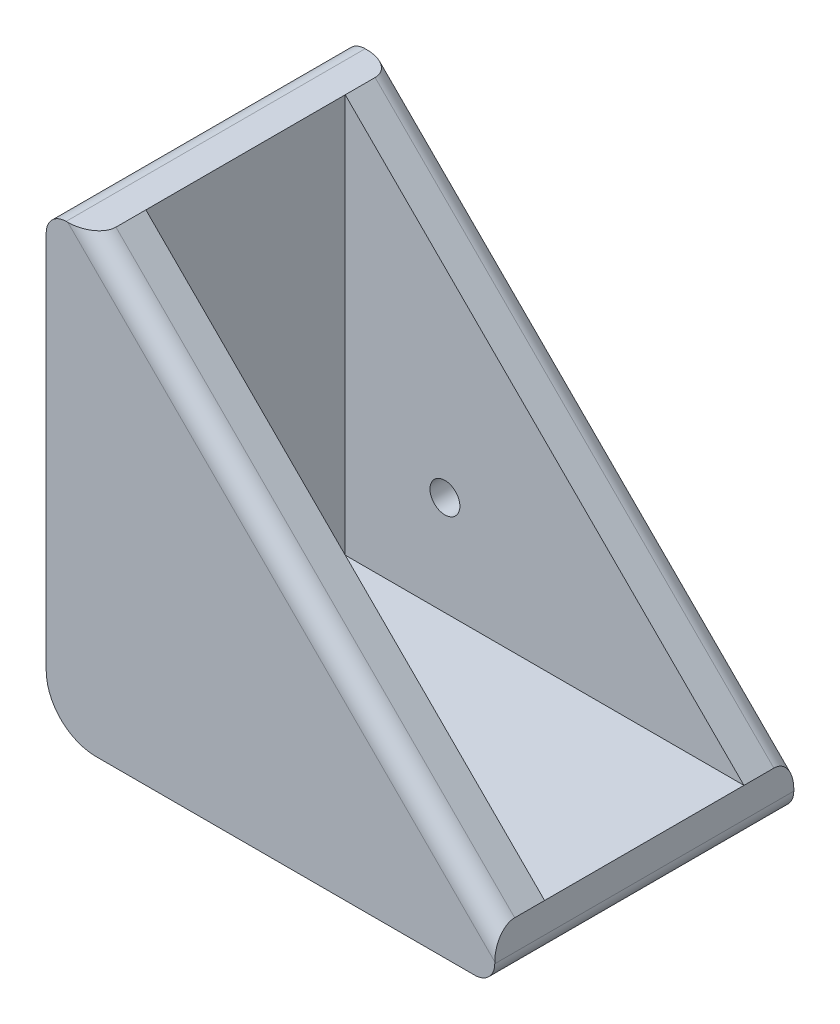
ISO-10303-21;
HEADER;
FILE_DESCRIPTION(('STEP AP214'),'2;1');
FILE_NAME('part.step','',(''),(''),'','','');
FILE_SCHEMA(('AUTOMOTIVE_DESIGN { 1 0 10303 214 1 1 1 1 }'));
ENDSEC;
DATA;
#1=APPLICATION_CONTEXT('core data for automotive mechanical design processes');
#2=APPLICATION_PROTOCOL_DEFINITION('international standard','automotive_design',2000,#1);
#3=PRODUCT_CONTEXT('',#1,'mechanical');
#4=PRODUCT('Part','Part','',(#3));
#5=PRODUCT_RELATED_PRODUCT_CATEGORY('part','',(#4));
#6=PRODUCT_DEFINITION_FORMATION('','',#4);
#7=PRODUCT_DEFINITION_CONTEXT('part definition',#1,'design');
#8=PRODUCT_DEFINITION('design','',#6,#7);
#9=PRODUCT_DEFINITION_SHAPE('','',#8);
#10=(LENGTH_UNIT() NAMED_UNIT(*) SI_UNIT(.MILLI.,.METRE.));
#11=(NAMED_UNIT(*) PLANE_ANGLE_UNIT() SI_UNIT($,.RADIAN.));
#12=(NAMED_UNIT(*) SI_UNIT($,.STERADIAN.) SOLID_ANGLE_UNIT());
#13=UNCERTAINTY_MEASURE_WITH_UNIT(LENGTH_MEASURE(1.E-05),#10,'distance_accuracy_value','');
#14=(GEOMETRIC_REPRESENTATION_CONTEXT(3) GLOBAL_UNCERTAINTY_ASSIGNED_CONTEXT((#13)) GLOBAL_UNIT_ASSIGNED_CONTEXT((#10,
#11,#12)) REPRESENTATION_CONTEXT('',''));
#15=CARTESIAN_POINT('',(0.,0.,0.));
#16=DIRECTION('',(0.,0.,1.));
#17=DIRECTION('',(1.,0.,0.));
#18=AXIS2_PLACEMENT_3D('',#15,#16,#17);
#19=CARTESIAN_POINT('',(5.,5.,30.));
#20=DIRECTION('',(0.,-1.,0.));
#21=DIRECTION('',(1.,0.,0.));
#22=AXIS2_PLACEMENT_3D('',#19,#20,#21);
#23=PLANE('',#22);
#24=CARTESIAN_POINT('',(15.,5.,15.));
#25=DIRECTION('',(0.,-1.,0.));
#26=DIRECTION('',(1.,0.,0.));
#27=AXIS2_PLACEMENT_3D('',#24,#25,#26);
#28=CIRCLE('',#27,1.5);
#29=CARTESIAN_POINT('',(16.5,5.,15.));
#30=VERTEX_POINT('',#29);
#31=EDGE_CURVE('E251',#30,#30,#28,.T.);
#32=ORIENTED_EDGE('',*,*,#31,.T.);
#33=EDGE_LOOP('',(#32));
#34=FACE_BOUND('',#33,.T.);
#35=DIRECTION('',(0.,0.,-1.));
#36=VECTOR('',#35,1.);
#37=CARTESIAN_POINT('',(45.,5.,30.));
#38=LINE('',#37,#36);
#39=CARTESIAN_POINT('',(45.,5.,25.));
#40=VERTEX_POINT('',#39);
#41=CARTESIAN_POINT('',(45.,5.,5.));
#42=VERTEX_POINT('',#41);
#43=EDGE_CURVE('E152',#40,#42,#38,.T.);
#44=ORIENTED_EDGE('',*,*,#43,.T.);
#45=DIRECTION('',(-1.,0.,0.));
#46=VECTOR('',#45,1.);
#47=CARTESIAN_POINT('',(5.,5.,5.));
#48=LINE('',#47,#46);
#49=CARTESIAN_POINT('',(5.,5.,5.));
#50=VERTEX_POINT('',#49);
#51=EDGE_CURVE('E151',#42,#50,#48,.T.);
#52=ORIENTED_EDGE('',*,*,#51,.T.);
#53=DIRECTION('',(0.,0.,-1.));
#54=VECTOR('',#53,1.);
#55=CARTESIAN_POINT('',(5.,5.,30.));
#56=LINE('',#55,#54);
#57=CARTESIAN_POINT('',(5.,5.,25.));
#58=VERTEX_POINT('',#57);
#59=EDGE_CURVE('E144',#58,#50,#56,.T.);
#60=ORIENTED_EDGE('',*,*,#59,.F.);
#61=DIRECTION('',(1.,0.,0.));
#62=VECTOR('',#61,1.);
#63=CARTESIAN_POINT('',(45.,5.,25.));
#64=LINE('',#63,#62);
#65=EDGE_CURVE('E129',#58,#40,#64,.T.);
#66=ORIENTED_EDGE('',*,*,#65,.T.);
#67=EDGE_LOOP('',(#44,#52,#60,#66));
#68=FACE_BOUND('',#67,.T.);
#69=ADVANCED_FACE('F33',(#34,#68),#23,.F.);
#70=CARTESIAN_POINT('',(5.,45.,30.));
#71=DIRECTION('',(-1.,0.,0.));
#72=DIRECTION('',(0.,-1.,0.));
#73=AXIS2_PLACEMENT_3D('',#70,#71,#72);
#74=PLANE('',#73);
#75=ORIENTED_EDGE('',*,*,#59,.T.);
#76=DIRECTION('',(0.,1.,0.));
#77=VECTOR('',#76,1.);
#78=CARTESIAN_POINT('',(5.,45.,5.));
#79=LINE('',#78,#77);
#80=CARTESIAN_POINT('',(5.,45.,5.));
#81=VERTEX_POINT('',#80);
#82=EDGE_CURVE('E250',#50,#81,#79,.T.);
#83=ORIENTED_EDGE('',*,*,#82,.T.);
#84=DIRECTION('',(0.,0.,-1.));
#85=VECTOR('',#84,1.);
#86=CARTESIAN_POINT('',(5.,45.,30.));
#87=LINE('',#86,#85);
#88=CARTESIAN_POINT('',(5.,45.,25.));
#89=VERTEX_POINT('',#88);
#90=EDGE_CURVE('E147',#89,#81,#87,.T.);
#91=ORIENTED_EDGE('',*,*,#90,.F.);
#92=DIRECTION('',(0.,-1.,0.));
#93=VECTOR('',#92,1.);
#94=CARTESIAN_POINT('',(5.,5.,25.));
#95=LINE('',#94,#93);
#96=EDGE_CURVE('E132',#89,#58,#95,.T.);
#97=ORIENTED_EDGE('',*,*,#96,.T.);
#98=EDGE_LOOP('',(#75,#83,#91,#97));
#99=FACE_BOUND('',#98,.T.);
#100=ADVANCED_FACE('F143',(#99),#74,.F.);
#101=CARTESIAN_POINT('',(45.,0.,30.));
#102=DIRECTION('',(0.,1.,0.));
#103=DIRECTION('',(-1.,0.,0.));
#104=AXIS2_PLACEMENT_3D('',#101,#102,#103);
#105=PLANE('',#104);
#106=CARTESIAN_POINT('',(15.,0.,15.));
#107=DIRECTION('',(0.,-1.,0.));
#108=DIRECTION('',(1.,0.,0.));
#109=AXIS2_PLACEMENT_3D('',#106,#107,#108);
#110=CIRCLE('',#109,1.5);
#111=CARTESIAN_POINT('',(16.5,0.,15.));
#112=VERTEX_POINT('',#111);
#113=EDGE_CURVE('E255',#112,#112,#110,.T.);
#114=ORIENTED_EDGE('',*,*,#113,.F.);
#115=EDGE_LOOP('',(#114));
#116=FACE_BOUND('',#115,.T.);
#117=DIRECTION('',(1.,0.,0.));
#118=VECTOR('',#117,1.);
#119=CARTESIAN_POINT('',(45.,0.,30.));
#120=LINE('',#119,#118);
#121=CARTESIAN_POINT('',(5.00000000000002,0.,30.));
#122=VERTEX_POINT('',#121);
#123=CARTESIAN_POINT('',(43.,0.,30.));
#124=VERTEX_POINT('',#123);
#125=EDGE_CURVE('E206',#122,#124,#120,.T.);
#126=ORIENTED_EDGE('',*,*,#125,.F.);
#127=DIRECTION('',(0.,0.,-1.));
#128=VECTOR('',#127,1.);
#129=CARTESIAN_POINT('',(5.,0.,30.));
#130=LINE('',#129,#128);
#131=CARTESIAN_POINT('',(5.00000000000002,0.,0.));
#132=VERTEX_POINT('',#131);
#133=EDGE_CURVE('E198',#122,#132,#130,.T.);
#134=ORIENTED_EDGE('',*,*,#133,.T.);
#135=DIRECTION('',(1.,0.,0.));
#136=VECTOR('',#135,1.);
#137=CARTESIAN_POINT('',(45.,0.,0.));
#138=LINE('',#137,#136);
#139=CARTESIAN_POINT('',(43.,0.,0.));
#140=VERTEX_POINT('',#139);
#141=EDGE_CURVE('E205',#132,#140,#138,.T.);
#142=ORIENTED_EDGE('',*,*,#141,.T.);
#143=DIRECTION('',(0.,0.,-1.));
#144=VECTOR('',#143,1.);
#145=CARTESIAN_POINT('',(43.,0.,30.));
#146=LINE('',#145,#144);
#147=EDGE_CURVE('E195',#140,#124,#146,.F.);
#148=ORIENTED_EDGE('',*,*,#147,.T.);
#149=EDGE_LOOP('',(#126,#134,#142,#148));
#150=FACE_BOUND('',#149,.T.);
#151=ADVANCED_FACE('F204',(#116,#150),#105,.F.);
#152=CARTESIAN_POINT('',(45.,5.,30.));
#153=DIRECTION('',(-1.,0.,0.));
#154=DIRECTION('',(0.,0.,1.));
#155=AXIS2_PLACEMENT_3D('',#152,#153,#154);
#156=PLANE('',#155);
#157=DIRECTION('',(0.,1.,0.));
#158=VECTOR('',#157,1.);
#159=CARTESIAN_POINT('',(45.,5.,0.));
#160=LINE('',#159,#158);
#161=CARTESIAN_POINT('',(45.,2.,0.));
#162=VERTEX_POINT('',#161);
#163=CARTESIAN_POINT('',(45.,2.17157287525381,0.));
#164=VERTEX_POINT('',#163);
#165=EDGE_CURVE('E212',#162,#164,#160,.T.);
#166=ORIENTED_EDGE('',*,*,#165,.T.);
#167=CARTESIAN_POINT('',(45.,2.17157287525381,2.));
#168=DIRECTION('',(-1.,0.,0.));
#169=DIRECTION('',(0.,-1.,0.));
#170=AXIS2_PLACEMENT_3D('',#167,#168,#169);
#171=ELLIPSE('',#170,2.82842712474619,2.);
#172=CARTESIAN_POINT('',(45.,5.,2.));
#173=VERTEX_POINT('',#172);
#174=EDGE_CURVE('E173',#164,#173,#171,.F.);
#175=ORIENTED_EDGE('',*,*,#174,.T.);
#176=DIRECTION('',(0.,0.,-1.));
#177=VECTOR('',#176,1.);
#178=CARTESIAN_POINT('',(45.,5.,5.));
#179=LINE('',#178,#177);
#180=EDGE_CURVE('E246',#42,#173,#179,.T.);
#181=ORIENTED_EDGE('',*,*,#180,.F.);
#182=ORIENTED_EDGE('',*,*,#43,.F.);
#183=CARTESIAN_POINT('',(45.,5.,28.));
#184=VERTEX_POINT('',#183);
#185=EDGE_CURVE('E155',#184,#40,#38,.T.);
#186=ORIENTED_EDGE('',*,*,#185,.F.);
#187=CARTESIAN_POINT('',(45.,2.17157287525381,28.));
#188=DIRECTION('',(-1.,0.,0.));
#189=DIRECTION('',(0.,-1.,0.));
#190=AXIS2_PLACEMENT_3D('',#187,#188,#189);
#191=ELLIPSE('',#190,2.82842712474619,2.);
#192=CARTESIAN_POINT('',(45.,2.17157287525381,30.));
#193=VERTEX_POINT('',#192);
#194=EDGE_CURVE('E171',#184,#193,#191,.F.);
#195=ORIENTED_EDGE('',*,*,#194,.T.);
#196=DIRECTION('',(0.,1.,0.));
#197=VECTOR('',#196,1.);
#198=CARTESIAN_POINT('',(45.,5.,30.));
#199=LINE('',#198,#197);
#200=CARTESIAN_POINT('',(45.,2.,30.));
#201=VERTEX_POINT('',#200);
#202=EDGE_CURVE('E224',#201,#193,#199,.T.);
#203=ORIENTED_EDGE('',*,*,#202,.F.);
#204=DIRECTION('',(0.,0.,-1.));
#205=VECTOR('',#204,1.);
#206=CARTESIAN_POINT('',(45.,2.,30.));
#207=LINE('',#206,#205);
#208=EDGE_CURVE('E168',#201,#162,#207,.T.);
#209=ORIENTED_EDGE('',*,*,#208,.T.);
#210=EDGE_LOOP('',(#166,#175,#181,#182,#186,#195,#203,#209));
#211=FACE_BOUND('',#210,.T.);
#212=ADVANCED_FACE('F279',(#211),#156,.F.);
#213=CARTESIAN_POINT('',(0.,45.,30.));
#214=DIRECTION('',(0.,-1.,0.));
#215=DIRECTION('',(0.,0.,-1.));
#216=AXIS2_PLACEMENT_3D('',#213,#214,#215);
#217=PLANE('',#216);
#218=DIRECTION('',(0.,0.,-1.));
#219=VECTOR('',#218,1.);
#220=CARTESIAN_POINT('',(5.,45.,5.));
#221=LINE('',#220,#219);
#222=CARTESIAN_POINT('',(5.,45.,2.));
#223=VERTEX_POINT('',#222);
#224=EDGE_CURVE('E148',#81,#223,#221,.T.);
#225=ORIENTED_EDGE('',*,*,#224,.T.);
#226=CARTESIAN_POINT('',(2.1715728752538,45.,2.));
#227=DIRECTION('',(0.,-1.,0.));
#228=DIRECTION('',(1.,0.,0.));
#229=AXIS2_PLACEMENT_3D('',#226,#227,#228);
#230=ELLIPSE('',#229,2.82842712474619,2.);
#231=CARTESIAN_POINT('',(2.1715728752538,45.,0.));
#232=VERTEX_POINT('',#231);
#233=EDGE_CURVE('E181',#223,#232,#230,.F.);
#234=ORIENTED_EDGE('',*,*,#233,.T.);
#235=DIRECTION('',(-1.,0.,0.));
#236=VECTOR('',#235,1.);
#237=CARTESIAN_POINT('',(0.,45.,0.));
#238=LINE('',#237,#236);
#239=CARTESIAN_POINT('',(2.,45.,0.));
#240=VERTEX_POINT('',#239);
#241=EDGE_CURVE('E215',#232,#240,#238,.T.);
#242=ORIENTED_EDGE('',*,*,#241,.T.);
#243=DIRECTION('',(0.,0.,-1.));
#244=VECTOR('',#243,1.);
#245=CARTESIAN_POINT('',(2.,45.,30.));
#246=LINE('',#245,#244);
#247=CARTESIAN_POINT('',(2.,45.,30.));
#248=VERTEX_POINT('',#247);
#249=EDGE_CURVE('E177',#240,#248,#246,.F.);
#250=ORIENTED_EDGE('',*,*,#249,.T.);
#251=DIRECTION('',(-1.,0.,0.));
#252=VECTOR('',#251,1.);
#253=CARTESIAN_POINT('',(0.,45.,30.));
#254=LINE('',#253,#252);
#255=CARTESIAN_POINT('',(2.1715728752538,45.,30.));
#256=VERTEX_POINT('',#255);
#257=EDGE_CURVE('E228',#256,#248,#254,.T.);
#258=ORIENTED_EDGE('',*,*,#257,.F.);
#259=CARTESIAN_POINT('',(2.1715728752538,45.,28.));
#260=DIRECTION('',(0.,-1.,0.));
#261=DIRECTION('',(1.,0.,0.));
#262=AXIS2_PLACEMENT_3D('',#259,#260,#261);
#263=ELLIPSE('',#262,2.82842712474619,2.);
#264=CARTESIAN_POINT('',(5.,45.,28.));
#265=VERTEX_POINT('',#264);
#266=EDGE_CURVE('E179',#256,#265,#263,.F.);
#267=ORIENTED_EDGE('',*,*,#266,.T.);
#268=EDGE_CURVE('E153',#265,#89,#87,.T.);
#269=ORIENTED_EDGE('',*,*,#268,.T.);
#270=ORIENTED_EDGE('',*,*,#90,.T.);
#271=EDGE_LOOP('',(#225,#234,#242,#250,#258,#267,#269,#270));
#272=FACE_BOUND('',#271,.T.);
#273=ADVANCED_FACE('F236',(#272),#217,.F.);
#274=CARTESIAN_POINT('',(0.,0.,30.));
#275=DIRECTION('',(1.,0.,0.));
#276=DIRECTION('',(0.,0.,-1.));
#277=AXIS2_PLACEMENT_3D('',#274,#275,#276);
#278=PLANE('',#277);
#279=DIRECTION('',(0.,-1.,0.));
#280=VECTOR('',#279,1.);
#281=CARTESIAN_POINT('',(0.,0.,0.));
#282=LINE('',#281,#280);
#283=CARTESIAN_POINT('',(0.,43.,0.));
#284=VERTEX_POINT('',#283);
#285=CARTESIAN_POINT('',(0.,5.,0.));
#286=VERTEX_POINT('',#285);
#287=EDGE_CURVE('E223',#284,#286,#282,.T.);
#288=ORIENTED_EDGE('',*,*,#287,.T.);
#289=DIRECTION('',(0.,0.,-1.));
#290=VECTOR('',#289,1.);
#291=CARTESIAN_POINT('',(0.,5.,30.));
#292=LINE('',#291,#290);
#293=CARTESIAN_POINT('',(0.,5.,30.));
#294=VERTEX_POINT('',#293);
#295=EDGE_CURVE('E41',#286,#294,#292,.F.);
#296=ORIENTED_EDGE('',*,*,#295,.T.);
#297=DIRECTION('',(0.,-1.,0.));
#298=VECTOR('',#297,1.);
#299=CARTESIAN_POINT('',(0.,0.,30.));
#300=LINE('',#299,#298);
#301=CARTESIAN_POINT('',(0.,43.,30.));
#302=VERTEX_POINT('',#301);
#303=EDGE_CURVE('E219',#302,#294,#300,.T.);
#304=ORIENTED_EDGE('',*,*,#303,.F.);
#305=DIRECTION('',(0.,0.,-1.));
#306=VECTOR('',#305,1.);
#307=CARTESIAN_POINT('',(0.,43.,30.));
#308=LINE('',#307,#306);
#309=EDGE_CURVE('E192',#302,#284,#308,.T.);
#310=ORIENTED_EDGE('',*,*,#309,.T.);
#311=EDGE_LOOP('',(#288,#296,#304,#310));
#312=FACE_BOUND('',#311,.T.);
#313=ADVANCED_FACE('F269',(#312),#278,.F.);
#314=CARTESIAN_POINT('',(0.,0.,30.));
#315=DIRECTION('',(0.,0.,-1.));
#316=DIRECTION('',(-1.,0.,0.));
#317=AXIS2_PLACEMENT_3D('',#314,#315,#316);
#318=PLANE('',#317);
#319=ORIENTED_EDGE('',*,*,#303,.T.);
#320=CARTESIAN_POINT('',(5.,5.,30.));
#321=DIRECTION('',(0.,0.,-1.));
#322=DIRECTION('',(-1.,0.,0.));
#323=AXIS2_PLACEMENT_3D('',#320,#321,#322);
#324=CIRCLE('',#323,5.);
#325=EDGE_CURVE('E11',#294,#122,#324,.F.);
#326=ORIENTED_EDGE('',*,*,#325,.T.);
#327=ORIENTED_EDGE('',*,*,#125,.T.);
#328=CARTESIAN_POINT('',(43.,2.,30.));
#329=DIRECTION('',(0.,0.,-1.));
#330=DIRECTION('',(-1.,0.,0.));
#331=AXIS2_PLACEMENT_3D('',#328,#329,#330);
#332=CIRCLE('',#331,2.);
#333=EDGE_CURVE('E183',#124,#201,#332,.F.);
#334=ORIENTED_EDGE('',*,*,#333,.T.);
#335=ORIENTED_EDGE('',*,*,#202,.T.);
#336=DIRECTION('',(-0.707106781186548,0.707106781186547,0.));
#337=VECTOR('',#336,1.);
#338=CARTESIAN_POINT('',(3.5857864376269,43.5857864376269,30.));
#339=LINE('',#338,#337);
#340=EDGE_CURVE('E187',#193,#256,#339,.T.);
#341=ORIENTED_EDGE('',*,*,#340,.T.);
#342=ORIENTED_EDGE('',*,*,#257,.T.);
#343=CARTESIAN_POINT('',(2.,43.,30.));
#344=DIRECTION('',(0.,0.,-1.));
#345=DIRECTION('',(-1.,0.,0.));
#346=AXIS2_PLACEMENT_3D('',#343,#344,#345);
#347=CIRCLE('',#346,2.);
#348=EDGE_CURVE('E185',#248,#302,#347,.F.);
#349=ORIENTED_EDGE('',*,*,#348,.T.);
#350=EDGE_LOOP('',(#319,#326,#327,#334,#335,#341,#342,#349));
#351=FACE_BOUND('',#350,.T.);
#352=ADVANCED_FACE('F271',(#351),#318,.F.);
#353=CARTESIAN_POINT('',(0.,0.,0.));
#354=DIRECTION('',(0.,0.,-1.));
#355=DIRECTION('',(-1.,0.,0.));
#356=AXIS2_PLACEMENT_3D('',#353,#354,#355);
#357=PLANE('',#356);
#358=CARTESIAN_POINT('',(15.,15.,0.));
#359=DIRECTION('',(0.,0.,1.));
#360=DIRECTION('',(1.,0.,0.));
#361=AXIS2_PLACEMENT_3D('',#358,#359,#360);
#362=CIRCLE('',#361,1.5);
#363=CARTESIAN_POINT('',(16.5,15.,0.));
#364=VERTEX_POINT('',#363);
#365=EDGE_CURVE('E342',#364,#364,#362,.T.);
#366=ORIENTED_EDGE('',*,*,#365,.T.);
#367=EDGE_LOOP('',(#366));
#368=FACE_BOUND('',#367,.T.);
#369=ORIENTED_EDGE('',*,*,#141,.F.);
#370=CARTESIAN_POINT('',(5.,5.,0.));
#371=DIRECTION('',(0.,0.,-1.));
#372=DIRECTION('',(-1.,0.,0.));
#373=AXIS2_PLACEMENT_3D('',#370,#371,#372);
#374=CIRCLE('',#373,5.);
#375=EDGE_CURVE('E55',#132,#286,#374,.T.);
#376=ORIENTED_EDGE('',*,*,#375,.T.);
#377=ORIENTED_EDGE('',*,*,#287,.F.);
#378=CARTESIAN_POINT('',(2.,43.,0.));
#379=DIRECTION('',(0.,0.,-1.));
#380=DIRECTION('',(-1.,0.,0.));
#381=AXIS2_PLACEMENT_3D('',#378,#379,#380);
#382=CIRCLE('',#381,2.);
#383=EDGE_CURVE('E163',#284,#240,#382,.T.);
#384=ORIENTED_EDGE('',*,*,#383,.T.);
#385=ORIENTED_EDGE('',*,*,#241,.F.);
#386=DIRECTION('',(0.707106781186548,-0.707106781186547,0.));
#387=VECTOR('',#386,1.);
#388=CARTESIAN_POINT('',(23.5857864376269,23.5857864376269,0.));
#389=LINE('',#388,#387);
#390=EDGE_CURVE('E165',#232,#164,#389,.T.);
#391=ORIENTED_EDGE('',*,*,#390,.T.);
#392=ORIENTED_EDGE('',*,*,#165,.F.);
#393=CARTESIAN_POINT('',(43.,2.,0.));
#394=DIRECTION('',(0.,0.,-1.));
#395=DIRECTION('',(-1.,0.,0.));
#396=AXIS2_PLACEMENT_3D('',#393,#394,#395);
#397=CIRCLE('',#396,2.);
#398=EDGE_CURVE('E160',#162,#140,#397,.T.);
#399=ORIENTED_EDGE('',*,*,#398,.T.);
#400=EDGE_LOOP('',(#369,#376,#377,#384,#385,#391,#392,#399));
#401=FACE_BOUND('',#400,.T.);
#402=ADVANCED_FACE('F209',(#368,#401),#357,.T.);
#403=CARTESIAN_POINT('',(5.,45.,25.));
#404=DIRECTION('',(0.707106781186547,0.707106781186548,0.));
#405=DIRECTION('',(-0.707106781186548,0.707106781186547,0.));
#406=AXIS2_PLACEMENT_3D('',#403,#404,#405);
#407=PLANE('',#406);
#408=ORIENTED_EDGE('',*,*,#268,.F.);
#409=DIRECTION('',(-0.707106781186548,0.707106781186547,0.));
#410=VECTOR('',#409,1.);
#411=CARTESIAN_POINT('',(45.,5.,28.));
#412=LINE('',#411,#410);
#413=EDGE_CURVE('E190',#265,#184,#412,.F.);
#414=ORIENTED_EDGE('',*,*,#413,.T.);
#415=ORIENTED_EDGE('',*,*,#185,.T.);
#416=DIRECTION('',(-0.707106781186548,0.707106781186547,0.));
#417=VECTOR('',#416,1.);
#418=CARTESIAN_POINT('',(5.,45.,25.));
#419=LINE('',#418,#417);
#420=EDGE_CURVE('E134',#40,#89,#419,.T.);
#421=ORIENTED_EDGE('',*,*,#420,.T.);
#422=EDGE_LOOP('',(#408,#414,#415,#421));
#423=FACE_BOUND('',#422,.T.);
#424=ADVANCED_FACE('F316',(#423),#407,.T.);
#425=CARTESIAN_POINT('',(0.,0.,25.));
#426=DIRECTION('',(0.,0.,1.));
#427=DIRECTION('',(1.,0.,0.));
#428=AXIS2_PLACEMENT_3D('',#425,#426,#427);
#429=PLANE('',#428);
#430=ORIENTED_EDGE('',*,*,#96,.F.);
#431=ORIENTED_EDGE('',*,*,#420,.F.);
#432=ORIENTED_EDGE('',*,*,#65,.F.);
#433=EDGE_LOOP('',(#430,#431,#432));
#434=FACE_BOUND('',#433,.T.);
#435=ADVANCED_FACE('F131',(#434),#429,.F.);
#436=CARTESIAN_POINT('',(45.,5.,5.));
#437=DIRECTION('',(0.707106781186547,0.707106781186548,0.));
#438=DIRECTION('',(-0.707106781186548,0.707106781186547,0.));
#439=AXIS2_PLACEMENT_3D('',#436,#437,#438);
#440=PLANE('',#439);
#441=ORIENTED_EDGE('',*,*,#180,.T.);
#442=DIRECTION('',(0.707106781186548,-0.707106781186547,0.));
#443=VECTOR('',#442,1.);
#444=CARTESIAN_POINT('',(45.,5.,2.));
#445=LINE('',#444,#443);
#446=EDGE_CURVE('E175',#173,#223,#445,.F.);
#447=ORIENTED_EDGE('',*,*,#446,.T.);
#448=ORIENTED_EDGE('',*,*,#224,.F.);
#449=DIRECTION('',(0.707106781186548,-0.707106781186547,0.));
#450=VECTOR('',#449,1.);
#451=CARTESIAN_POINT('',(45.,5.,5.));
#452=LINE('',#451,#450);
#453=EDGE_CURVE('E244',#81,#42,#452,.T.);
#454=ORIENTED_EDGE('',*,*,#453,.T.);
#455=EDGE_LOOP('',(#441,#447,#448,#454));
#456=FACE_BOUND('',#455,.T.);
#457=ADVANCED_FACE('F243',(#456),#440,.T.);
#458=CARTESIAN_POINT('',(0.,0.,5.));
#459=DIRECTION('',(0.,0.,1.));
#460=DIRECTION('',(1.,0.,0.));
#461=AXIS2_PLACEMENT_3D('',#458,#459,#460);
#462=PLANE('',#461);
#463=CARTESIAN_POINT('',(15.,15.,5.));
#464=DIRECTION('',(0.,0.,1.));
#465=DIRECTION('',(1.,0.,0.));
#466=AXIS2_PLACEMENT_3D('',#463,#464,#465);
#467=CIRCLE('',#466,1.5);
#468=CARTESIAN_POINT('',(16.5,15.,5.));
#469=VERTEX_POINT('',#468);
#470=EDGE_CURVE('E345',#469,#469,#467,.T.);
#471=ORIENTED_EDGE('',*,*,#470,.F.);
#472=EDGE_LOOP('',(#471));
#473=FACE_BOUND('',#472,.T.);
#474=ORIENTED_EDGE('',*,*,#453,.F.);
#475=ORIENTED_EDGE('',*,*,#82,.F.);
#476=ORIENTED_EDGE('',*,*,#51,.F.);
#477=EDGE_LOOP('',(#474,#475,#476));
#478=FACE_BOUND('',#477,.T.);
#479=ADVANCED_FACE('F249',(#473,#478),#462,.T.);
#480=CARTESIAN_POINT('',(15.,45.,15.));
#481=DIRECTION('',(0.,-1.,0.));
#482=DIRECTION('',(1.,0.,0.));
#483=AXIS2_PLACEMENT_3D('',#480,#481,#482);
#484=CYLINDRICAL_SURFACE('',#483,1.5);
#485=ORIENTED_EDGE('',*,*,#113,.T.);
#486=EDGE_LOOP('',(#485));
#487=FACE_BOUND('',#486,.T.);
#488=ORIENTED_EDGE('',*,*,#31,.F.);
#489=EDGE_LOOP('',(#488));
#490=FACE_BOUND('',#489,.T.);
#491=ADVANCED_FACE('F330',(#487,#490),#484,.F.);
#492=CARTESIAN_POINT('',(15.,15.,0.));
#493=DIRECTION('',(0.,0.,1.));
#494=DIRECTION('',(1.,0.,0.));
#495=AXIS2_PLACEMENT_3D('',#492,#493,#494);
#496=CYLINDRICAL_SURFACE('',#495,1.5);
#497=ORIENTED_EDGE('',*,*,#365,.F.);
#498=EDGE_LOOP('',(#497));
#499=FACE_BOUND('',#498,.T.);
#500=ORIENTED_EDGE('',*,*,#470,.T.);
#501=EDGE_LOOP('',(#500));
#502=FACE_BOUND('',#501,.T.);
#503=ADVANCED_FACE('F297',(#499,#502),#496,.F.);
#504=CARTESIAN_POINT('',(23.5857864376269,23.5857864376269,2.));
#505=DIRECTION('',(0.707106781186548,-0.707106781186547,0.));
#506=DIRECTION('',(0.707106781186547,0.707106781186548,0.));
#507=AXIS2_PLACEMENT_3D('',#504,#505,#506);
#508=CYLINDRICAL_SURFACE('',#507,2.);
#509=ORIENTED_EDGE('',*,*,#233,.F.);
#510=ORIENTED_EDGE('',*,*,#446,.F.);
#511=ORIENTED_EDGE('',*,*,#174,.F.);
#512=ORIENTED_EDGE('',*,*,#390,.F.);
#513=EDGE_LOOP('',(#509,#510,#511,#512));
#514=FACE_BOUND('',#513,.T.);
#515=ADVANCED_FACE('F262',(#514),#508,.T.);
#516=CARTESIAN_POINT('',(23.5857864376269,23.5857864376269,28.));
#517=DIRECTION('',(0.707106781186548,-0.707106781186547,0.));
#518=DIRECTION('',(0.707106781186547,0.707106781186548,0.));
#519=AXIS2_PLACEMENT_3D('',#516,#517,#518);
#520=CYLINDRICAL_SURFACE('',#519,2.);
#521=ORIENTED_EDGE('',*,*,#194,.F.);
#522=ORIENTED_EDGE('',*,*,#413,.F.);
#523=ORIENTED_EDGE('',*,*,#266,.F.);
#524=ORIENTED_EDGE('',*,*,#340,.F.);
#525=EDGE_LOOP('',(#521,#522,#523,#524));
#526=FACE_BOUND('',#525,.T.);
#527=ADVANCED_FACE('F296',(#526),#520,.T.);
#528=CARTESIAN_POINT('',(2.,43.,30.));
#529=DIRECTION('',(0.,0.,-1.));
#530=DIRECTION('',(-1.,0.,0.));
#531=AXIS2_PLACEMENT_3D('',#528,#529,#530);
#532=CYLINDRICAL_SURFACE('',#531,2.);
#533=ORIENTED_EDGE('',*,*,#348,.F.);
#534=ORIENTED_EDGE('',*,*,#249,.F.);
#535=ORIENTED_EDGE('',*,*,#383,.F.);
#536=ORIENTED_EDGE('',*,*,#309,.F.);
#537=EDGE_LOOP('',(#533,#534,#535,#536));
#538=FACE_BOUND('',#537,.T.);
#539=ADVANCED_FACE('F268',(#538),#532,.T.);
#540=CARTESIAN_POINT('',(43.,2.,30.));
#541=DIRECTION('',(0.,0.,-1.));
#542=DIRECTION('',(-1.,0.,0.));
#543=AXIS2_PLACEMENT_3D('',#540,#541,#542);
#544=CYLINDRICAL_SURFACE('',#543,2.);
#545=ORIENTED_EDGE('',*,*,#333,.F.);
#546=ORIENTED_EDGE('',*,*,#147,.F.);
#547=ORIENTED_EDGE('',*,*,#398,.F.);
#548=ORIENTED_EDGE('',*,*,#208,.F.);
#549=EDGE_LOOP('',(#545,#546,#547,#548));
#550=FACE_BOUND('',#549,.T.);
#551=ADVANCED_FACE('F302',(#550),#544,.T.);
#552=CARTESIAN_POINT('',(5.,5.,30.));
#553=DIRECTION('',(0.,0.,-1.));
#554=DIRECTION('',(-1.,0.,0.));
#555=AXIS2_PLACEMENT_3D('',#552,#553,#554);
#556=CYLINDRICAL_SURFACE('',#555,5.);
#557=ORIENTED_EDGE('',*,*,#325,.F.);
#558=ORIENTED_EDGE('',*,*,#295,.F.);
#559=ORIENTED_EDGE('',*,*,#375,.F.);
#560=ORIENTED_EDGE('',*,*,#133,.F.);
#561=EDGE_LOOP('',(#557,#558,#559,#560));
#562=FACE_BOUND('',#561,.T.);
#563=ADVANCED_FACE('F35',(#562),#556,.T.);
#564=CLOSED_SHELL('',(#69,#100,#151,#212,#273,#313,#352,#402,#424,#435,#457,#479,#491,#503,#515,
#527,#539,#551,#563));
#565=MANIFOLD_SOLID_BREP('B2',#564);
#566=ADVANCED_BREP_SHAPE_REPRESENTATION('',(#18,#565),#14);
#567=SHAPE_DEFINITION_REPRESENTATION(#9,#566);
ENDSEC;
END-ISO-10303-21;
